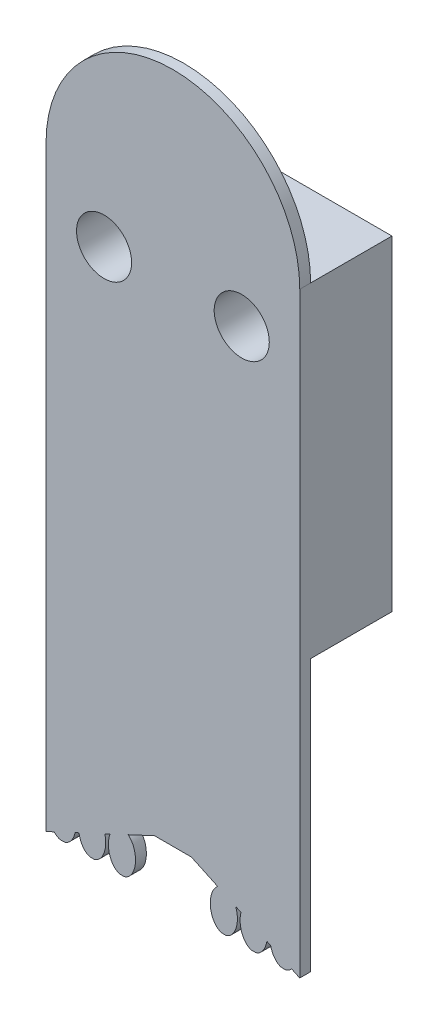
ISO-10303-21;
HEADER;
FILE_DESCRIPTION(('STEP AP214'),'2;1');
FILE_NAME('part.step','',(''),(''),'','','');
FILE_SCHEMA(('AUTOMOTIVE_DESIGN { 1 0 10303 214 1 1 1 1 }'));
ENDSEC;
DATA;
#1=APPLICATION_CONTEXT('core data for automotive mechanical design processes');
#2=APPLICATION_PROTOCOL_DEFINITION('international standard','automotive_design',2000,#1);
#3=PRODUCT_CONTEXT('',#1,'mechanical');
#4=PRODUCT('Part','Part','',(#3));
#5=PRODUCT_RELATED_PRODUCT_CATEGORY('part','',(#4));
#6=PRODUCT_DEFINITION_FORMATION('','',#4);
#7=PRODUCT_DEFINITION_CONTEXT('part definition',#1,'design');
#8=PRODUCT_DEFINITION('design','',#6,#7);
#9=PRODUCT_DEFINITION_SHAPE('','',#8);
#10=(LENGTH_UNIT() NAMED_UNIT(*) SI_UNIT(.MILLI.,.METRE.));
#11=(NAMED_UNIT(*) PLANE_ANGLE_UNIT() SI_UNIT($,.RADIAN.));
#12=(NAMED_UNIT(*) SI_UNIT($,.STERADIAN.) SOLID_ANGLE_UNIT());
#13=UNCERTAINTY_MEASURE_WITH_UNIT(LENGTH_MEASURE(1.E-05),#10,'distance_accuracy_value','');
#14=(GEOMETRIC_REPRESENTATION_CONTEXT(3) GLOBAL_UNCERTAINTY_ASSIGNED_CONTEXT((#13)) GLOBAL_UNIT_ASSIGNED_CONTEXT((#10,
#11,#12)) REPRESENTATION_CONTEXT('',''));
#15=CARTESIAN_POINT('',(0.,0.,0.));
#16=DIRECTION('',(0.,0.,1.));
#17=DIRECTION('',(1.,0.,0.));
#18=AXIS2_PLACEMENT_3D('',#15,#16,#17);
#19=CARTESIAN_POINT('',(-79.3736541190516,0.,15.));
#20=DIRECTION('',(1.,0.,0.));
#21=DIRECTION('',(0.,1.,0.));
#22=AXIS2_PLACEMENT_3D('',#19,#20,#21);
#23=PLANE('',#22);
#24=DIRECTION('',(0.,-1.,0.));
#25=VECTOR('',#24,1.);
#26=CARTESIAN_POINT('',(-79.3736541190516,0.,0.));
#27=LINE('',#26,#25);
#28=CARTESIAN_POINT('',(-79.3736541190514,-283.368909969103,0.));
#29=VERTEX_POINT('',#28);
#30=CARTESIAN_POINT('',(-79.3736541190514,-343.368909969103,0.));
#31=VERTEX_POINT('',#30);
#32=EDGE_CURVE('E79',#29,#31,#27,.T.);
#33=ORIENTED_EDGE('',*,*,#32,.F.);
#34=DIRECTION('',(0.,0.,-1.));
#35=VECTOR('',#34,1.);
#36=CARTESIAN_POINT('',(-79.3736541190514,-283.368909969103,15.));
#37=LINE('',#36,#35);
#38=CARTESIAN_POINT('',(-79.3736541190514,-283.368909969103,15.));
#39=VERTEX_POINT('',#38);
#40=EDGE_CURVE('E11',#39,#29,#37,.T.);
#41=ORIENTED_EDGE('',*,*,#40,.F.);
#42=DIRECTION('',(0.,0.,-1.));
#43=VECTOR('',#42,1.);
#44=CARTESIAN_POINT('',(-79.3736541190514,-283.368909969103,17.));
#45=LINE('',#44,#43);
#46=CARTESIAN_POINT('',(-79.3736541190514,-283.368909969103,17.));
#47=VERTEX_POINT('',#46);
#48=EDGE_CURVE('E204',#47,#39,#45,.T.);
#49=ORIENTED_EDGE('',*,*,#48,.F.);
#50=DIRECTION('',(0.,-1.,0.));
#51=VECTOR('',#50,1.);
#52=CARTESIAN_POINT('',(-79.3736541190515,0.,17.));
#53=LINE('',#52,#51);
#54=CARTESIAN_POINT('',(-79.3736541190514,-393.368909969103,17.));
#55=VERTEX_POINT('',#54);
#56=EDGE_CURVE('E131',#47,#55,#53,.T.);
#57=ORIENTED_EDGE('',*,*,#56,.T.);
#58=DIRECTION('',(0.,0.,-1.));
#59=VECTOR('',#58,1.);
#60=CARTESIAN_POINT('',(-79.3736541190514,-393.368909969103,17.));
#61=LINE('',#60,#59);
#62=CARTESIAN_POINT('',(-79.3736541190514,-393.368909969103,15.));
#63=VERTEX_POINT('',#62);
#64=EDGE_CURVE('E207',#55,#63,#61,.T.);
#65=ORIENTED_EDGE('',*,*,#64,.T.);
#66=DIRECTION('',(0.,-1.,0.));
#67=VECTOR('',#66,1.);
#68=CARTESIAN_POINT('',(-79.3736541190515,0.,15.));
#69=LINE('',#68,#67);
#70=CARTESIAN_POINT('',(-79.3736541190514,-343.368909969103,15.));
#71=VERTEX_POINT('',#70);
#72=EDGE_CURVE('E55',#71,#63,#69,.T.);
#73=ORIENTED_EDGE('',*,*,#72,.F.);
#74=DIRECTION('',(0.,0.,-1.));
#75=VECTOR('',#74,1.);
#76=CARTESIAN_POINT('',(-79.3736541190514,-343.368909969103,15.));
#77=LINE('',#76,#75);
#78=EDGE_CURVE('E91',#71,#31,#77,.T.);
#79=ORIENTED_EDGE('',*,*,#78,.T.);
#80=EDGE_LOOP('',(#33,#41,#49,#57,#65,#73,#79));
#81=FACE_BOUND('',#80,.T.);
#82=ADVANCED_FACE('F39',(#81),#23,.T.);
#83=CARTESIAN_POINT('',(0.,-283.368909969103,15.));
#84=DIRECTION('',(0.,1.,0.));
#85=DIRECTION('',(0.,0.,1.));
#86=AXIS2_PLACEMENT_3D('',#83,#84,#85);
#87=PLANE('',#86);
#88=DIRECTION('',(1.,0.,0.));
#89=VECTOR('',#88,1.);
#90=CARTESIAN_POINT('',(0.,-283.368909969103,0.));
#91=LINE('',#90,#89);
#92=CARTESIAN_POINT('',(-126.16159358842,-283.368909969103,0.));
#93=VERTEX_POINT('',#92);
#94=EDGE_CURVE('E96',#93,#29,#91,.T.);
#95=ORIENTED_EDGE('',*,*,#94,.F.);
#96=DIRECTION('',(0.,0.,-1.));
#97=VECTOR('',#96,1.);
#98=CARTESIAN_POINT('',(-126.16159358842,-283.368909969103,15.));
#99=LINE('',#98,#97);
#100=CARTESIAN_POINT('',(-126.16159358842,-283.368909969103,15.));
#101=VERTEX_POINT('',#100);
#102=EDGE_CURVE('E48',#101,#93,#99,.T.);
#103=ORIENTED_EDGE('',*,*,#102,.F.);
#104=DIRECTION('',(1.,0.,0.));
#105=VECTOR('',#104,1.);
#106=CARTESIAN_POINT('',(0.,-283.368909969103,15.));
#107=LINE('',#106,#105);
#108=EDGE_CURVE('E82',#101,#39,#107,.T.);
#109=ORIENTED_EDGE('',*,*,#108,.T.);
#110=ORIENTED_EDGE('',*,*,#40,.T.);
#111=EDGE_LOOP('',(#95,#103,#109,#110));
#112=FACE_BOUND('',#111,.T.);
#113=ADVANCED_FACE('F460',(#112),#87,.T.);
#114=CARTESIAN_POINT('',(-126.16159358842,0.,15.));
#115=DIRECTION('',(1.,0.,0.));
#116=DIRECTION('',(0.,0.,-1.));
#117=AXIS2_PLACEMENT_3D('',#114,#115,#116);
#118=PLANE('',#117);
#119=DIRECTION('',(0.,-1.,0.));
#120=VECTOR('',#119,1.);
#121=CARTESIAN_POINT('',(-126.16159358842,0.,0.));
#122=LINE('',#121,#120);
#123=CARTESIAN_POINT('',(-126.16159358842,-343.368909969103,0.));
#124=VERTEX_POINT('',#123);
#125=EDGE_CURVE('E76',#93,#124,#122,.T.);
#126=ORIENTED_EDGE('',*,*,#125,.T.);
#127=DIRECTION('',(0.,0.,-1.));
#128=VECTOR('',#127,1.);
#129=CARTESIAN_POINT('',(-126.16159358842,-343.368909969103,15.));
#130=LINE('',#129,#128);
#131=CARTESIAN_POINT('',(-126.16159358842,-343.368909969103,15.));
#132=VERTEX_POINT('',#131);
#133=EDGE_CURVE('E86',#132,#124,#130,.T.);
#134=ORIENTED_EDGE('',*,*,#133,.F.);
#135=DIRECTION('',(0.,-1.,0.));
#136=VECTOR('',#135,1.);
#137=CARTESIAN_POINT('',(-126.16159358842,0.,15.));
#138=LINE('',#137,#136);
#139=CARTESIAN_POINT('',(-126.16159358842,-393.368909969103,15.));
#140=VERTEX_POINT('',#139);
#141=EDGE_CURVE('E135',#132,#140,#138,.T.);
#142=ORIENTED_EDGE('',*,*,#141,.T.);
#143=DIRECTION('',(0.,0.,-1.));
#144=VECTOR('',#143,1.);
#145=CARTESIAN_POINT('',(-126.16159358842,-393.368909969103,17.));
#146=LINE('',#145,#144);
#147=CARTESIAN_POINT('',(-126.16159358842,-393.368909969103,17.));
#148=VERTEX_POINT('',#147);
#149=EDGE_CURVE('E112',#148,#140,#146,.T.);
#150=ORIENTED_EDGE('',*,*,#149,.F.);
#151=DIRECTION('',(0.,-1.,0.));
#152=VECTOR('',#151,1.);
#153=CARTESIAN_POINT('',(-126.16159358842,0.,17.));
#154=LINE('',#153,#152);
#155=CARTESIAN_POINT('',(-126.16159358842,-283.368909969103,17.));
#156=VERTEX_POINT('',#155);
#157=EDGE_CURVE('E202',#156,#148,#154,.T.);
#158=ORIENTED_EDGE('',*,*,#157,.F.);
#159=DIRECTION('',(0.,0.,-1.));
#160=VECTOR('',#159,1.);
#161=CARTESIAN_POINT('',(-126.16159358842,-283.368909969103,17.));
#162=LINE('',#161,#160);
#163=EDGE_CURVE('E128',#156,#101,#162,.T.);
#164=ORIENTED_EDGE('',*,*,#163,.T.);
#165=ORIENTED_EDGE('',*,*,#102,.T.);
#166=EDGE_LOOP('',(#126,#134,#142,#150,#158,#164,#165));
#167=FACE_BOUND('',#166,.T.);
#168=ADVANCED_FACE('F93',(#167),#118,.F.);
#169=CARTESIAN_POINT('',(-115.46159358842,-294.630909969103,15.));
#170=DIRECTION('',(0.,0.,-1.));
#171=DIRECTION('',(-1.,0.,0.));
#172=AXIS2_PLACEMENT_3D('',#169,#170,#171);
#173=CYLINDRICAL_SURFACE('',#172,5.08000000000001);
#174=CARTESIAN_POINT('',(-115.46159358842,-294.630909969103,0.));
#175=DIRECTION('',(0.,0.,1.));
#176=DIRECTION('',(1.,0.,0.));
#177=AXIS2_PLACEMENT_3D('',#174,#175,#176);
#178=CIRCLE('',#177,5.08000000000001);
#179=CARTESIAN_POINT('',(-110.38159358842,-294.630909969103,0.));
#180=VERTEX_POINT('',#179);
#181=EDGE_CURVE('E111',#180,#180,#178,.T.);
#182=ORIENTED_EDGE('',*,*,#181,.F.);
#183=EDGE_LOOP('',(#182));
#184=FACE_BOUND('',#183,.T.);
#185=CARTESIAN_POINT('',(-115.46159358842,-294.630909969103,17.));
#186=DIRECTION('',(0.,0.,1.));
#187=DIRECTION('',(1.,0.,0.));
#188=AXIS2_PLACEMENT_3D('',#185,#186,#187);
#189=CIRCLE('',#188,5.08000000000001);
#190=CARTESIAN_POINT('',(-110.38159358842,-294.630909969103,17.));
#191=VERTEX_POINT('',#190);
#192=EDGE_CURVE('E122',#191,#191,#189,.F.);
#193=ORIENTED_EDGE('',*,*,#192,.F.);
#194=EDGE_LOOP('',(#193));
#195=FACE_BOUND('',#194,.T.);
#196=ADVANCED_FACE('F117',(#184,#195),#173,.F.);
#197=CARTESIAN_POINT('',(-90.0736541190514,-294.630909969103,15.));
#198=DIRECTION('',(0.,0.,-1.));
#199=DIRECTION('',(-1.,0.,0.));
#200=AXIS2_PLACEMENT_3D('',#197,#198,#199);
#201=CYLINDRICAL_SURFACE('',#200,5.08000000000001);
#202=CARTESIAN_POINT('',(-90.0736541190514,-294.630909969103,0.));
#203=DIRECTION('',(0.,0.,1.));
#204=DIRECTION('',(1.,0.,0.));
#205=AXIS2_PLACEMENT_3D('',#202,#203,#204);
#206=CIRCLE('',#205,5.08000000000001);
#207=CARTESIAN_POINT('',(-84.9936541190514,-294.630909969103,0.));
#208=VERTEX_POINT('',#207);
#209=EDGE_CURVE('E108',#208,#208,#206,.T.);
#210=ORIENTED_EDGE('',*,*,#209,.F.);
#211=EDGE_LOOP('',(#210));
#212=FACE_BOUND('',#211,.T.);
#213=CARTESIAN_POINT('',(-90.0736541190514,-294.630909969103,17.));
#214=DIRECTION('',(0.,0.,1.));
#215=DIRECTION('',(1.,0.,0.));
#216=AXIS2_PLACEMENT_3D('',#213,#214,#215);
#217=CIRCLE('',#216,5.08000000000001);
#218=CARTESIAN_POINT('',(-84.9936541190514,-294.630909969103,17.));
#219=VERTEX_POINT('',#218);
#220=EDGE_CURVE('E124',#219,#219,#217,.F.);
#221=ORIENTED_EDGE('',*,*,#220,.F.);
#222=EDGE_LOOP('',(#221));
#223=FACE_BOUND('',#222,.T.);
#224=ADVANCED_FACE('F41',(#212,#223),#201,.F.);
#225=CARTESIAN_POINT('',(0.,-343.368909969103,15.));
#226=DIRECTION('',(0.,1.,0.));
#227=DIRECTION('',(0.,0.,1.));
#228=AXIS2_PLACEMENT_3D('',#225,#226,#227);
#229=PLANE('',#228);
#230=DIRECTION('',(1.,0.,0.));
#231=VECTOR('',#230,1.);
#232=CARTESIAN_POINT('',(0.,-343.368909969103,0.));
#233=LINE('',#232,#231);
#234=EDGE_CURVE('E71',#124,#31,#233,.T.);
#235=ORIENTED_EDGE('',*,*,#234,.T.);
#236=ORIENTED_EDGE('',*,*,#78,.F.);
#237=DIRECTION('',(1.,0.,0.));
#238=VECTOR('',#237,1.);
#239=CARTESIAN_POINT('',(0.,-343.368909969103,15.));
#240=LINE('',#239,#238);
#241=EDGE_CURVE('E88',#132,#71,#240,.T.);
#242=ORIENTED_EDGE('',*,*,#241,.F.);
#243=ORIENTED_EDGE('',*,*,#133,.T.);
#244=EDGE_LOOP('',(#235,#236,#242,#243));
#245=FACE_BOUND('',#244,.T.);
#246=ADVANCED_FACE('F87',(#245),#229,.F.);
#247=CARTESIAN_POINT('',(0.,0.,0.));
#248=DIRECTION('',(0.,0.,1.));
#249=DIRECTION('',(1.,0.,0.));
#250=AXIS2_PLACEMENT_3D('',#247,#248,#249);
#251=PLANE('',#250);
#252=ORIENTED_EDGE('',*,*,#209,.T.);
#253=EDGE_LOOP('',(#252));
#254=FACE_BOUND('',#253,.T.);
#255=ORIENTED_EDGE('',*,*,#181,.T.);
#256=EDGE_LOOP('',(#255));
#257=FACE_BOUND('',#256,.T.);
#258=ORIENTED_EDGE('',*,*,#32,.T.);
#259=ORIENTED_EDGE('',*,*,#234,.F.);
#260=ORIENTED_EDGE('',*,*,#125,.F.);
#261=ORIENTED_EDGE('',*,*,#94,.T.);
#262=EDGE_LOOP('',(#258,#259,#260,#261));
#263=FACE_BOUND('',#262,.T.);
#264=ADVANCED_FACE('F73',(#254,#257,#263),#251,.F.);
#265=CARTESIAN_POINT('',(0.,0.,15.));
#266=DIRECTION('',(0.,0.,1.));
#267=DIRECTION('',(1.,0.,0.));
#268=AXIS2_PLACEMENT_3D('',#265,#266,#267);
#269=PLANE('',#268);
#270=ORIENTED_EDGE('',*,*,#141,.F.);
#271=ORIENTED_EDGE('',*,*,#241,.T.);
#272=ORIENTED_EDGE('',*,*,#72,.T.);
#273=DIRECTION('',(-0.906307787036652,0.422618261740694,0.));
#274=VECTOR('',#273,1.);
#275=CARTESIAN_POINT('',(-164.845660146689,-353.512659000546,15.));
#276=LINE('',#275,#274);
#277=CARTESIAN_POINT('',(-80.880341233661,-392.666330229117,15.));
#278=VERTEX_POINT('',#277);
#279=EDGE_CURVE('E195',#63,#278,#276,.T.);
#280=ORIENTED_EDGE('',*,*,#279,.T.);
#281=CARTESIAN_POINT('',(-82.3736541190514,-389.658833361416,15.));
#282=DIRECTION('',(0.,0.,-1.));
#283=DIRECTION('',(0.,1.,0.));
#284=AXIS2_PLACEMENT_3D('',#281,#282,#283);
#285=ELLIPSE('',#284,3.74999999999998,2.5);
#286=CARTESIAN_POINT('',(-82.0098278081775,-393.368909969103,15.));
#287=VERTEX_POINT('',#286);
#288=EDGE_CURVE('E194',#278,#287,#285,.T.);
#289=ORIENTED_EDGE('',*,*,#288,.T.);
#290=DIRECTION('',(1.,0.,0.));
#291=VECTOR('',#290,1.);
#292=CARTESIAN_POINT('',(0.,-393.368909969103,15.));
#293=LINE('',#292,#291);
#294=CARTESIAN_POINT('',(-82.7374804299253,-393.368909969103,15.));
#295=VERTEX_POINT('',#294);
#296=EDGE_CURVE('E179',#295,#287,#293,.T.);
#297=ORIENTED_EDGE('',*,*,#296,.F.);
#298=CARTESIAN_POINT('',(-84.7405099488571,-390.866303995451,15.));
#299=VERTEX_POINT('',#298);
#300=EDGE_CURVE('E191',#295,#299,#285,.T.);
#301=ORIENTED_EDGE('',*,*,#300,.T.);
#302=DIRECTION('',(-0.906307787036654,0.422618261740692,0.));
#303=VECTOR('',#302,1.);
#304=CARTESIAN_POINT('',(-164.845660146688,-353.512659000547,15.));
#305=LINE('',#304,#303);
#306=CARTESIAN_POINT('',(-85.44341611312,-390.538533468091,15.));
#307=VERTEX_POINT('',#306);
#308=EDGE_CURVE('E188',#299,#307,#305,.T.);
#309=ORIENTED_EDGE('',*,*,#308,.T.);
#310=CARTESIAN_POINT('',(-87.8736541190514,-389.658833361416,15.));
#311=DIRECTION('',(0.,0.,-1.));
#312=DIRECTION('',(0.,1.,0.));
#313=AXIS2_PLACEMENT_3D('',#310,#311,#312);
#314=ELLIPSE('',#313,3.74999999999998,2.5);
#315=CARTESIAN_POINT('',(-87.5098278081775,-393.368909969103,15.));
#316=VERTEX_POINT('',#315);
#317=EDGE_CURVE('E187',#307,#316,#314,.T.);
#318=ORIENTED_EDGE('',*,*,#317,.T.);
#319=CARTESIAN_POINT('',(-88.2374804299253,-393.368909969103,15.));
#320=VERTEX_POINT('',#319);
#321=EDGE_CURVE('E180',#320,#316,#293,.T.);
#322=ORIENTED_EDGE('',*,*,#321,.F.);
#323=CARTESIAN_POINT('',(-90.2080625994379,-388.31674232312,15.));
#324=VERTEX_POINT('',#323);
#325=EDGE_CURVE('E184',#320,#324,#314,.T.);
#326=ORIENTED_EDGE('',*,*,#325,.T.);
#327=DIRECTION('',(-0.906307787036678,0.42261826174064,0.));
#328=VECTOR('',#327,1.);
#329=CARTESIAN_POINT('',(-164.84566014667,-353.512659000561,15.));
#330=LINE('',#329,#328);
#331=CARTESIAN_POINT('',(-91.1785263244252,-387.864207656196,15.));
#332=VERTEX_POINT('',#331);
#333=EDGE_CURVE('E181',#324,#332,#330,.T.);
#334=ORIENTED_EDGE('',*,*,#333,.T.);
#335=CARTESIAN_POINT('',(-93.3736541190514,-389.658833361416,15.));
#336=DIRECTION('',(0.,0.,-1.));
#337=DIRECTION('',(0.,1.,0.));
#338=AXIS2_PLACEMENT_3D('',#335,#336,#337);
#339=ELLIPSE('',#338,3.74999999999998,2.5);
#340=CARTESIAN_POINT('',(-93.0098278081775,-393.368909969103,15.));
#341=VERTEX_POINT('',#340);
#342=EDGE_CURVE('E176',#332,#341,#339,.T.);
#343=ORIENTED_EDGE('',*,*,#342,.T.);
#344=CARTESIAN_POINT('',(-93.7374804299253,-393.368909969103,15.));
#345=VERTEX_POINT('',#344);
#346=EDGE_CURVE('E175',#345,#341,#293,.T.);
#347=ORIENTED_EDGE('',*,*,#346,.F.);
#348=CARTESIAN_POINT('',(-94.5035799181724,-386.313709701656,15.));
#349=VERTEX_POINT('',#348);
#350=EDGE_CURVE('E172',#345,#349,#339,.T.);
#351=ORIENTED_EDGE('',*,*,#350,.T.);
#352=DIRECTION('',(-0.906307787036653,0.422618261740693,0.));
#353=VECTOR('',#352,1.);
#354=CARTESIAN_POINT('',(-164.845660146688,-353.512659000546,15.));
#355=LINE('',#354,#353);
#356=CARTESIAN_POINT('',(-99.3736541190514,-384.042756806003,15.));
#357=VERTEX_POINT('',#356);
#358=EDGE_CURVE('E169',#349,#357,#355,.T.);
#359=ORIENTED_EDGE('',*,*,#358,.T.);
#360=DIRECTION('',(1.,0.,0.));
#361=VECTOR('',#360,1.);
#362=CARTESIAN_POINT('',(-6.28133342924796E-12,-384.042756806005,15.));
#363=LINE('',#362,#361);
#364=CARTESIAN_POINT('',(-106.16159358842,-384.042756806003,15.));
#365=VERTEX_POINT('',#364);
#366=EDGE_CURVE('E166',#365,#357,#363,.T.);
#367=ORIENTED_EDGE('',*,*,#366,.F.);
#368=DIRECTION('',(0.906307787036691,0.422618261740612,0.));
#369=VECTOR('',#368,1.);
#370=CARTESIAN_POINT('',(128.135791583047,-274.788091814884,15.));
#371=LINE('',#370,#369);
#372=CARTESIAN_POINT('',(-111.031667789299,-386.313709701656,15.));
#373=VERTEX_POINT('',#372);
#374=EDGE_CURVE('E163',#373,#365,#371,.T.);
#375=ORIENTED_EDGE('',*,*,#374,.F.);
#376=CARTESIAN_POINT('',(-112.16159358842,-389.658833361416,15.));
#377=DIRECTION('',(0.,0.,1.));
#378=DIRECTION('',(0.,1.,0.));
#379=AXIS2_PLACEMENT_3D('',#376,#377,#378);
#380=ELLIPSE('',#379,3.74999999999998,2.5);
#381=CARTESIAN_POINT('',(-111.797767277546,-393.368909969103,15.));
#382=VERTEX_POINT('',#381);
#383=EDGE_CURVE('E162',#382,#373,#380,.T.);
#384=ORIENTED_EDGE('',*,*,#383,.F.);
#385=DIRECTION('',(1.,0.,0.));
#386=VECTOR('',#385,1.);
#387=CARTESIAN_POINT('',(0.,-393.368909969103,15.));
#388=LINE('',#387,#386);
#389=CARTESIAN_POINT('',(-112.525419899294,-393.368909969103,15.));
#390=VERTEX_POINT('',#389);
#391=EDGE_CURVE('E147',#390,#382,#388,.T.);
#392=ORIENTED_EDGE('',*,*,#391,.F.);
#393=CARTESIAN_POINT('',(-114.356721383046,-387.864207656196,15.));
#394=VERTEX_POINT('',#393);
#395=EDGE_CURVE('E159',#394,#390,#380,.T.);
#396=ORIENTED_EDGE('',*,*,#395,.F.);
#397=DIRECTION('',(0.90630778703676,0.422618261740463,0.));
#398=VECTOR('',#397,1.);
#399=CARTESIAN_POINT('',(128.135791583021,-274.788091814946,15.));
#400=LINE('',#399,#398);
#401=CARTESIAN_POINT('',(-115.327185108033,-388.316742323119,15.));
#402=VERTEX_POINT('',#401);
#403=EDGE_CURVE('E156',#402,#394,#400,.T.);
#404=ORIENTED_EDGE('',*,*,#403,.F.);
#405=CARTESIAN_POINT('',(-117.66159358842,-389.658833361416,15.));
#406=DIRECTION('',(0.,0.,1.));
#407=DIRECTION('',(0.,1.,0.));
#408=AXIS2_PLACEMENT_3D('',#405,#406,#407);
#409=ELLIPSE('',#408,3.74999999999998,2.5);
#410=CARTESIAN_POINT('',(-117.297767277546,-393.368909969103,15.));
#411=VERTEX_POINT('',#410);
#412=EDGE_CURVE('E155',#411,#402,#409,.T.);
#413=ORIENTED_EDGE('',*,*,#412,.F.);
#414=CARTESIAN_POINT('',(-118.025419899294,-393.368909969103,15.));
#415=VERTEX_POINT('',#414);
#416=EDGE_CURVE('E148',#415,#411,#388,.T.);
#417=ORIENTED_EDGE('',*,*,#416,.F.);
#418=CARTESIAN_POINT('',(-120.091831594351,-390.538533468091,15.));
#419=VERTEX_POINT('',#418);
#420=EDGE_CURVE('E152',#419,#415,#409,.T.);
#421=ORIENTED_EDGE('',*,*,#420,.F.);
#422=DIRECTION('',(0.906307787036657,0.422618261740685,0.));
#423=VECTOR('',#422,1.);
#424=CARTESIAN_POINT('',(128.135791583061,-274.788091814855,15.));
#425=LINE('',#424,#423);
#426=CARTESIAN_POINT('',(-120.794737758614,-390.866303995451,15.));
#427=VERTEX_POINT('',#426);
#428=EDGE_CURVE('E149',#427,#419,#425,.T.);
#429=ORIENTED_EDGE('',*,*,#428,.F.);
#430=CARTESIAN_POINT('',(-123.16159358842,-389.658833361416,15.));
#431=DIRECTION('',(0.,0.,1.));
#432=DIRECTION('',(0.,1.,0.));
#433=AXIS2_PLACEMENT_3D('',#430,#431,#432);
#434=ELLIPSE('',#433,3.74999999999998,2.5);
#435=CARTESIAN_POINT('',(-122.797767277546,-393.368909969103,15.));
#436=VERTEX_POINT('',#435);
#437=EDGE_CURVE('E144',#436,#427,#434,.T.);
#438=ORIENTED_EDGE('',*,*,#437,.F.);
#439=CARTESIAN_POINT('',(-123.525419899294,-393.368909969103,15.));
#440=VERTEX_POINT('',#439);
#441=EDGE_CURVE('E143',#440,#436,#388,.T.);
#442=ORIENTED_EDGE('',*,*,#441,.F.);
#443=CARTESIAN_POINT('',(-124.65490647381,-392.666330229117,15.));
#444=VERTEX_POINT('',#443);
#445=EDGE_CURVE('E140',#444,#440,#434,.T.);
#446=ORIENTED_EDGE('',*,*,#445,.F.);
#447=DIRECTION('',(0.906307787036652,0.422618261740694,0.));
#448=VECTOR('',#447,1.);
#449=CARTESIAN_POINT('',(128.135791583062,-274.788091814852,15.));
#450=LINE('',#449,#448);
#451=EDGE_CURVE('E137',#140,#444,#450,.T.);
#452=ORIENTED_EDGE('',*,*,#451,.F.);
#453=EDGE_LOOP('',(#270,#271,#272,#280,#289,#297,#301,#309,#318,#322,#326,#334,#343,#347,#351,
#359,#367,#375,#384,#392,#396,#404,#413,#417,#421,#429,#438,#442,#446,#452));
#454=FACE_BOUND('',#453,.T.);
#455=ADVANCED_FACE('F474',(#454),#269,.F.);
#456=CARTESIAN_POINT('',(128.135791583062,-274.788091814852,17.));
#457=DIRECTION('',(-0.422618261740694,0.906307787036652,0.));
#458=DIRECTION('',(-0.906307787036652,-0.422618261740694,0.));
#459=AXIS2_PLACEMENT_3D('',#456,#457,#458);
#460=PLANE('',#459);
#461=ORIENTED_EDGE('',*,*,#451,.T.);
#462=DIRECTION('',(0.,0.,-1.));
#463=VECTOR('',#462,1.);
#464=CARTESIAN_POINT('',(-124.65490647381,-392.666330229117,17.));
#465=LINE('',#464,#463);
#466=CARTESIAN_POINT('',(-124.65490647381,-392.666330229117,17.));
#467=VERTEX_POINT('',#466);
#468=EDGE_CURVE('E284',#467,#444,#465,.T.);
#469=ORIENTED_EDGE('',*,*,#468,.F.);
#470=DIRECTION('',(0.906307787036652,0.422618261740694,0.));
#471=VECTOR('',#470,1.);
#472=CARTESIAN_POINT('',(128.135791583062,-274.788091814852,17.));
#473=LINE('',#472,#471);
#474=EDGE_CURVE('E297',#148,#467,#473,.T.);
#475=ORIENTED_EDGE('',*,*,#474,.F.);
#476=ORIENTED_EDGE('',*,*,#149,.T.);
#477=EDGE_LOOP('',(#461,#469,#475,#476));
#478=FACE_BOUND('',#477,.T.);
#479=ADVANCED_FACE('F291',(#478),#460,.F.);
#480=CARTESIAN_POINT('',(-123.16159358842,-389.658833361416,17.));
#481=DIRECTION('',(0.,0.,1.));
#482=DIRECTION('',(0.,1.,0.));
#483=AXIS2_PLACEMENT_3D('',#480,#481,#482);
#484=ELLIPSE('',#483,3.74999999999998,2.5);
#485=DIRECTION('',(0.,0.,-1.));
#486=VECTOR('',#485,1.);
#487=SURFACE_OF_LINEAR_EXTRUSION('',#484,#486);
#488=ORIENTED_EDGE('',*,*,#445,.T.);
#489=DIRECTION('',(0.,0.,-1.));
#490=VECTOR('',#489,1.);
#491=CARTESIAN_POINT('',(-123.525419899294,-393.368909969103,17.));
#492=LINE('',#491,#490);
#493=CARTESIAN_POINT('',(-123.525419899294,-393.368909969103,17.));
#494=VERTEX_POINT('',#493);
#495=EDGE_CURVE('E281',#494,#440,#492,.T.);
#496=ORIENTED_EDGE('',*,*,#495,.F.);
#497=EDGE_CURVE('E487',#467,#494,#484,.T.);
#498=ORIENTED_EDGE('',*,*,#497,.F.);
#499=ORIENTED_EDGE('',*,*,#468,.T.);
#500=EDGE_LOOP('',(#488,#496,#498,#499));
#501=FACE_BOUND('',#500,.T.);
#502=ADVANCED_FACE('F478',(#501),#487,.F.);
#503=CARTESIAN_POINT('',(0.,-393.368909969103,17.));
#504=DIRECTION('',(0.,1.,0.));
#505=DIRECTION('',(0.,0.,1.));
#506=AXIS2_PLACEMENT_3D('',#503,#504,#505);
#507=PLANE('',#506);
#508=ORIENTED_EDGE('',*,*,#441,.T.);
#509=DIRECTION('',(0.,0.,-1.));
#510=VECTOR('',#509,1.);
#511=CARTESIAN_POINT('',(-122.797767277546,-393.368909969103,17.));
#512=LINE('',#511,#510);
#513=CARTESIAN_POINT('',(-122.797767277546,-393.368909969103,17.));
#514=VERTEX_POINT('',#513);
#515=EDGE_CURVE('E278',#514,#436,#512,.T.);
#516=ORIENTED_EDGE('',*,*,#515,.F.);
#517=DIRECTION('',(1.,0.,0.));
#518=VECTOR('',#517,1.);
#519=CARTESIAN_POINT('',(0.,-393.368909969103,17.));
#520=LINE('',#519,#518);
#521=EDGE_CURVE('E491',#494,#514,#520,.T.);
#522=ORIENTED_EDGE('',*,*,#521,.F.);
#523=ORIENTED_EDGE('',*,*,#495,.T.);
#524=EDGE_LOOP('',(#508,#516,#522,#523));
#525=FACE_BOUND('',#524,.T.);
#526=ADVANCED_FACE('F484',(#525),#507,.F.);
#527=ORIENTED_EDGE('',*,*,#437,.T.);
#528=DIRECTION('',(0.,0.,-1.));
#529=VECTOR('',#528,1.);
#530=CARTESIAN_POINT('',(-120.794737758614,-390.866303995451,17.));
#531=LINE('',#530,#529);
#532=CARTESIAN_POINT('',(-120.794737758614,-390.866303995451,17.));
#533=VERTEX_POINT('',#532);
#534=EDGE_CURVE('E275',#533,#427,#531,.T.);
#535=ORIENTED_EDGE('',*,*,#534,.F.);
#536=EDGE_CURVE('E492',#514,#533,#484,.T.);
#537=ORIENTED_EDGE('',*,*,#536,.F.);
#538=ORIENTED_EDGE('',*,*,#515,.T.);
#539=EDGE_LOOP('',(#527,#535,#537,#538));
#540=FACE_BOUND('',#539,.T.);
#541=ADVANCED_FACE('F479',(#540),#487,.F.);
#542=CARTESIAN_POINT('',(128.135791583061,-274.788091814855,17.));
#543=DIRECTION('',(-0.422618261740685,0.906307787036657,0.));
#544=DIRECTION('',(-0.906307787036657,-0.422618261740685,0.));
#545=AXIS2_PLACEMENT_3D('',#542,#543,#544);
#546=PLANE('',#545);
#547=ORIENTED_EDGE('',*,*,#428,.T.);
#548=DIRECTION('',(0.,0.,-1.));
#549=VECTOR('',#548,1.);
#550=CARTESIAN_POINT('',(-120.091831594351,-390.538533468091,17.));
#551=LINE('',#550,#549);
#552=CARTESIAN_POINT('',(-120.091831594351,-390.538533468091,17.));
#553=VERTEX_POINT('',#552);
#554=EDGE_CURVE('E272',#553,#419,#551,.T.);
#555=ORIENTED_EDGE('',*,*,#554,.F.);
#556=DIRECTION('',(0.906307787036657,0.422618261740685,0.));
#557=VECTOR('',#556,1.);
#558=CARTESIAN_POINT('',(128.135791583061,-274.788091814855,17.));
#559=LINE('',#558,#557);
#560=EDGE_CURVE('E497',#533,#553,#559,.T.);
#561=ORIENTED_EDGE('',*,*,#560,.F.);
#562=ORIENTED_EDGE('',*,*,#534,.T.);
#563=EDGE_LOOP('',(#547,#555,#561,#562));
#564=FACE_BOUND('',#563,.T.);
#565=ADVANCED_FACE('F483',(#564),#546,.F.);
#566=CARTESIAN_POINT('',(-117.66159358842,-389.658833361416,17.));
#567=DIRECTION('',(0.,0.,1.));
#568=DIRECTION('',(0.,1.,0.));
#569=AXIS2_PLACEMENT_3D('',#566,#567,#568);
#570=ELLIPSE('',#569,3.74999999999998,2.5);
#571=DIRECTION('',(0.,0.,-1.));
#572=VECTOR('',#571,1.);
#573=SURFACE_OF_LINEAR_EXTRUSION('',#570,#572);
#574=ORIENTED_EDGE('',*,*,#420,.T.);
#575=DIRECTION('',(0.,0.,-1.));
#576=VECTOR('',#575,1.);
#577=CARTESIAN_POINT('',(-118.025419899294,-393.368909969103,17.));
#578=LINE('',#577,#576);
#579=CARTESIAN_POINT('',(-118.025419899294,-393.368909969103,17.));
#580=VERTEX_POINT('',#579);
#581=EDGE_CURVE('E269',#580,#415,#578,.T.);
#582=ORIENTED_EDGE('',*,*,#581,.F.);
#583=EDGE_CURVE('E499',#553,#580,#570,.T.);
#584=ORIENTED_EDGE('',*,*,#583,.F.);
#585=ORIENTED_EDGE('',*,*,#554,.T.);
#586=EDGE_LOOP('',(#574,#582,#584,#585));
#587=FACE_BOUND('',#586,.T.);
#588=ADVANCED_FACE('F511',(#587),#573,.F.);
#589=ORIENTED_EDGE('',*,*,#416,.T.);
#590=DIRECTION('',(0.,0.,-1.));
#591=VECTOR('',#590,1.);
#592=CARTESIAN_POINT('',(-117.297767277546,-393.368909969103,17.));
#593=LINE('',#592,#591);
#594=CARTESIAN_POINT('',(-117.297767277546,-393.368909969103,17.));
#595=VERTEX_POINT('',#594);
#596=EDGE_CURVE('E266',#595,#411,#593,.T.);
#597=ORIENTED_EDGE('',*,*,#596,.F.);
#598=EDGE_CURVE('E496',#580,#595,#520,.T.);
#599=ORIENTED_EDGE('',*,*,#598,.F.);
#600=ORIENTED_EDGE('',*,*,#581,.T.);
#601=EDGE_LOOP('',(#589,#597,#599,#600));
#602=FACE_BOUND('',#601,.T.);
#603=ADVANCED_FACE('F509',(#602),#507,.F.);
#604=ORIENTED_EDGE('',*,*,#412,.T.);
#605=DIRECTION('',(0.,0.,-1.));
#606=VECTOR('',#605,1.);
#607=CARTESIAN_POINT('',(-115.327185108033,-388.316742323119,17.));
#608=LINE('',#607,#606);
#609=CARTESIAN_POINT('',(-115.327185108033,-388.316742323119,17.));
#610=VERTEX_POINT('',#609);
#611=EDGE_CURVE('E263',#610,#402,#608,.T.);
#612=ORIENTED_EDGE('',*,*,#611,.F.);
#613=EDGE_CURVE('E502',#595,#610,#570,.T.);
#614=ORIENTED_EDGE('',*,*,#613,.F.);
#615=ORIENTED_EDGE('',*,*,#596,.T.);
#616=EDGE_LOOP('',(#604,#612,#614,#615));
#617=FACE_BOUND('',#616,.T.);
#618=ADVANCED_FACE('F505',(#617),#573,.F.);
#619=CARTESIAN_POINT('',(128.135791583021,-274.788091814946,17.));
#620=DIRECTION('',(-0.422618261740463,0.90630778703676,0.));
#621=DIRECTION('',(-0.90630778703676,-0.422618261740463,0.));
#622=AXIS2_PLACEMENT_3D('',#619,#620,#621);
#623=PLANE('',#622);
#624=ORIENTED_EDGE('',*,*,#403,.T.);
#625=DIRECTION('',(0.,0.,-1.));
#626=VECTOR('',#625,1.);
#627=CARTESIAN_POINT('',(-114.356721383046,-387.864207656196,17.));
#628=LINE('',#627,#626);
#629=CARTESIAN_POINT('',(-114.356721383046,-387.864207656196,17.));
#630=VERTEX_POINT('',#629);
#631=EDGE_CURVE('E260',#630,#394,#628,.T.);
#632=ORIENTED_EDGE('',*,*,#631,.F.);
#633=DIRECTION('',(0.90630778703676,0.422618261740463,0.));
#634=VECTOR('',#633,1.);
#635=CARTESIAN_POINT('',(128.135791583021,-274.788091814946,17.));
#636=LINE('',#635,#634);
#637=EDGE_CURVE('E503',#610,#630,#636,.T.);
#638=ORIENTED_EDGE('',*,*,#637,.F.);
#639=ORIENTED_EDGE('',*,*,#611,.T.);
#640=EDGE_LOOP('',(#624,#632,#638,#639));
#641=FACE_BOUND('',#640,.T.);
#642=ADVANCED_FACE('F508',(#641),#623,.F.);
#643=CARTESIAN_POINT('',(-112.16159358842,-389.658833361416,17.));
#644=DIRECTION('',(0.,0.,1.));
#645=DIRECTION('',(0.,1.,0.));
#646=AXIS2_PLACEMENT_3D('',#643,#644,#645);
#647=ELLIPSE('',#646,3.74999999999998,2.5);
#648=DIRECTION('',(0.,0.,-1.));
#649=VECTOR('',#648,1.);
#650=SURFACE_OF_LINEAR_EXTRUSION('',#647,#649);
#651=ORIENTED_EDGE('',*,*,#395,.T.);
#652=DIRECTION('',(0.,0.,-1.));
#653=VECTOR('',#652,1.);
#654=CARTESIAN_POINT('',(-112.525419899294,-393.368909969103,17.));
#655=LINE('',#654,#653);
#656=CARTESIAN_POINT('',(-112.525419899294,-393.368909969103,17.));
#657=VERTEX_POINT('',#656);
#658=EDGE_CURVE('E257',#657,#390,#655,.T.);
#659=ORIENTED_EDGE('',*,*,#658,.F.);
#660=EDGE_CURVE('E526',#630,#657,#647,.T.);
#661=ORIENTED_EDGE('',*,*,#660,.F.);
#662=ORIENTED_EDGE('',*,*,#631,.T.);
#663=EDGE_LOOP('',(#651,#659,#661,#662));
#664=FACE_BOUND('',#663,.T.);
#665=ADVANCED_FACE('F514',(#664),#650,.F.);
#666=ORIENTED_EDGE('',*,*,#391,.T.);
#667=DIRECTION('',(0.,0.,-1.));
#668=VECTOR('',#667,1.);
#669=CARTESIAN_POINT('',(-111.797767277546,-393.368909969103,17.));
#670=LINE('',#669,#668);
#671=CARTESIAN_POINT('',(-111.797767277546,-393.368909969103,17.));
#672=VERTEX_POINT('',#671);
#673=EDGE_CURVE('E254',#672,#382,#670,.T.);
#674=ORIENTED_EDGE('',*,*,#673,.F.);
#675=EDGE_CURVE('E495',#657,#672,#520,.T.);
#676=ORIENTED_EDGE('',*,*,#675,.F.);
#677=ORIENTED_EDGE('',*,*,#658,.T.);
#678=EDGE_LOOP('',(#666,#674,#676,#677));
#679=FACE_BOUND('',#678,.T.);
#680=ADVANCED_FACE('F516',(#679),#507,.F.);
#681=ORIENTED_EDGE('',*,*,#383,.T.);
#682=DIRECTION('',(0.,0.,-1.));
#683=VECTOR('',#682,1.);
#684=CARTESIAN_POINT('',(-111.031667789299,-386.313709701656,17.));
#685=LINE('',#684,#683);
#686=CARTESIAN_POINT('',(-111.031667789299,-386.313709701656,17.));
#687=VERTEX_POINT('',#686);
#688=EDGE_CURVE('E251',#687,#373,#685,.T.);
#689=ORIENTED_EDGE('',*,*,#688,.F.);
#690=EDGE_CURVE('E529',#672,#687,#647,.T.);
#691=ORIENTED_EDGE('',*,*,#690,.F.);
#692=ORIENTED_EDGE('',*,*,#673,.T.);
#693=EDGE_LOOP('',(#681,#689,#691,#692));
#694=FACE_BOUND('',#693,.T.);
#695=ADVANCED_FACE('F519',(#694),#650,.F.);
#696=CARTESIAN_POINT('',(128.135791583047,-274.788091814884,17.));
#697=DIRECTION('',(-0.422618261740612,0.906307787036691,0.));
#698=DIRECTION('',(-0.906307787036691,-0.422618261740612,0.));
#699=AXIS2_PLACEMENT_3D('',#696,#697,#698);
#700=PLANE('',#699);
#701=ORIENTED_EDGE('',*,*,#374,.T.);
#702=DIRECTION('',(0.,0.,-1.));
#703=VECTOR('',#702,1.);
#704=CARTESIAN_POINT('',(-106.16159358842,-384.042756806003,17.));
#705=LINE('',#704,#703);
#706=CARTESIAN_POINT('',(-106.16159358842,-384.042756806003,17.));
#707=VERTEX_POINT('',#706);
#708=EDGE_CURVE('E248',#707,#365,#705,.T.);
#709=ORIENTED_EDGE('',*,*,#708,.F.);
#710=DIRECTION('',(0.906307787036691,0.422618261740612,0.));
#711=VECTOR('',#710,1.);
#712=CARTESIAN_POINT('',(128.135791583047,-274.788091814884,17.));
#713=LINE('',#712,#711);
#714=EDGE_CURVE('E530',#687,#707,#713,.T.);
#715=ORIENTED_EDGE('',*,*,#714,.F.);
#716=ORIENTED_EDGE('',*,*,#688,.T.);
#717=EDGE_LOOP('',(#701,#709,#715,#716));
#718=FACE_BOUND('',#717,.T.);
#719=ADVANCED_FACE('F523',(#718),#700,.F.);
#720=CARTESIAN_POINT('',(-6.28133342924796E-12,-384.042756806005,17.));
#721=DIRECTION('',(0.,1.,0.));
#722=DIRECTION('',(-1.,0.,0.));
#723=AXIS2_PLACEMENT_3D('',#720,#721,#722);
#724=PLANE('',#723);
#725=ORIENTED_EDGE('',*,*,#366,.T.);
#726=DIRECTION('',(0.,0.,-1.));
#727=VECTOR('',#726,1.);
#728=CARTESIAN_POINT('',(-99.3736541190514,-384.042756806003,17.));
#729=LINE('',#728,#727);
#730=CARTESIAN_POINT('',(-99.3736541190514,-384.042756806003,17.));
#731=VERTEX_POINT('',#730);
#732=EDGE_CURVE('E245',#731,#357,#729,.T.);
#733=ORIENTED_EDGE('',*,*,#732,.F.);
#734=DIRECTION('',(1.,0.,0.));
#735=VECTOR('',#734,1.);
#736=CARTESIAN_POINT('',(-6.28133342924796E-12,-384.042756806005,17.));
#737=LINE('',#736,#735);
#738=EDGE_CURVE('E532',#707,#731,#737,.T.);
#739=ORIENTED_EDGE('',*,*,#738,.F.);
#740=ORIENTED_EDGE('',*,*,#708,.T.);
#741=EDGE_LOOP('',(#725,#733,#739,#740));
#742=FACE_BOUND('',#741,.T.);
#743=ADVANCED_FACE('F556',(#742),#724,.F.);
#744=CARTESIAN_POINT('',(-164.845660146688,-353.512659000546,17.));
#745=DIRECTION('',(-0.422618261740693,-0.906307787036653,0.));
#746=DIRECTION('',(0.906307787036653,-0.422618261740693,0.));
#747=AXIS2_PLACEMENT_3D('',#744,#745,#746);
#748=PLANE('',#747);
#749=ORIENTED_EDGE('',*,*,#358,.F.);
#750=DIRECTION('',(0.,0.,-1.));
#751=VECTOR('',#750,1.);
#752=CARTESIAN_POINT('',(-94.5035799181724,-386.313709701656,17.));
#753=LINE('',#752,#751);
#754=CARTESIAN_POINT('',(-94.5035799181724,-386.313709701656,17.));
#755=VERTEX_POINT('',#754);
#756=EDGE_CURVE('E242',#755,#349,#753,.T.);
#757=ORIENTED_EDGE('',*,*,#756,.F.);
#758=DIRECTION('',(-0.906307787036653,0.422618261740693,0.));
#759=VECTOR('',#758,1.);
#760=CARTESIAN_POINT('',(-164.845660146688,-353.512659000546,17.));
#761=LINE('',#760,#759);
#762=EDGE_CURVE('E534',#755,#731,#761,.T.);
#763=ORIENTED_EDGE('',*,*,#762,.T.);
#764=ORIENTED_EDGE('',*,*,#732,.T.);
#765=EDGE_LOOP('',(#749,#757,#763,#764));
#766=FACE_BOUND('',#765,.T.);
#767=ADVANCED_FACE('F554',(#766),#748,.T.);
#768=CARTESIAN_POINT('',(-93.3736541190514,-389.658833361416,17.));
#769=DIRECTION('',(0.,0.,-1.));
#770=DIRECTION('',(0.,1.,0.));
#771=AXIS2_PLACEMENT_3D('',#768,#769,#770);
#772=ELLIPSE('',#771,3.74999999999998,2.5);
#773=DIRECTION('',(0.,0.,-1.));
#774=VECTOR('',#773,1.);
#775=SURFACE_OF_LINEAR_EXTRUSION('',#772,#774);
#776=ORIENTED_EDGE('',*,*,#350,.F.);
#777=DIRECTION('',(0.,0.,-1.));
#778=VECTOR('',#777,1.);
#779=CARTESIAN_POINT('',(-93.7374804299253,-393.368909969103,17.));
#780=LINE('',#779,#778);
#781=CARTESIAN_POINT('',(-93.7374804299253,-393.368909969103,17.));
#782=VERTEX_POINT('',#781);
#783=EDGE_CURVE('E239',#782,#345,#780,.T.);
#784=ORIENTED_EDGE('',*,*,#783,.F.);
#785=EDGE_CURVE('E537',#782,#755,#772,.T.);
#786=ORIENTED_EDGE('',*,*,#785,.T.);
#787=ORIENTED_EDGE('',*,*,#756,.T.);
#788=EDGE_LOOP('',(#776,#784,#786,#787));
#789=FACE_BOUND('',#788,.T.);
#790=ADVANCED_FACE('F552',(#789),#775,.T.);
#791=CARTESIAN_POINT('',(0.,-393.368909969103,17.));
#792=DIRECTION('',(0.,1.,0.));
#793=DIRECTION('',(0.,0.,1.));
#794=AXIS2_PLACEMENT_3D('',#791,#792,#793);
#795=PLANE('',#794);
#796=ORIENTED_EDGE('',*,*,#346,.T.);
#797=DIRECTION('',(0.,0.,-1.));
#798=VECTOR('',#797,1.);
#799=CARTESIAN_POINT('',(-93.0098278081775,-393.368909969103,17.));
#800=LINE('',#799,#798);
#801=CARTESIAN_POINT('',(-93.0098278081775,-393.368909969103,17.));
#802=VERTEX_POINT('',#801);
#803=EDGE_CURVE('E236',#802,#341,#800,.T.);
#804=ORIENTED_EDGE('',*,*,#803,.F.);
#805=DIRECTION('',(1.,0.,0.));
#806=VECTOR('',#805,1.);
#807=CARTESIAN_POINT('',(0.,-393.368909969103,17.));
#808=LINE('',#807,#806);
#809=EDGE_CURVE('E541',#782,#802,#808,.T.);
#810=ORIENTED_EDGE('',*,*,#809,.F.);
#811=ORIENTED_EDGE('',*,*,#783,.T.);
#812=EDGE_LOOP('',(#796,#804,#810,#811));
#813=FACE_BOUND('',#812,.T.);
#814=ADVANCED_FACE('F550',(#813),#795,.F.);
#815=ORIENTED_EDGE('',*,*,#342,.F.);
#816=DIRECTION('',(0.,0.,-1.));
#817=VECTOR('',#816,1.);
#818=CARTESIAN_POINT('',(-91.1785263244252,-387.864207656196,17.));
#819=LINE('',#818,#817);
#820=CARTESIAN_POINT('',(-91.1785263244252,-387.864207656196,17.));
#821=VERTEX_POINT('',#820);
#822=EDGE_CURVE('E233',#821,#332,#819,.T.);
#823=ORIENTED_EDGE('',*,*,#822,.F.);
#824=EDGE_CURVE('E542',#821,#802,#772,.T.);
#825=ORIENTED_EDGE('',*,*,#824,.T.);
#826=ORIENTED_EDGE('',*,*,#803,.T.);
#827=EDGE_LOOP('',(#815,#823,#825,#826));
#828=FACE_BOUND('',#827,.T.);
#829=ADVANCED_FACE('F545',(#828),#775,.T.);
#830=CARTESIAN_POINT('',(-164.84566014667,-353.512659000561,17.));
#831=DIRECTION('',(-0.42261826174064,-0.906307787036678,0.));
#832=DIRECTION('',(0.906307787036678,-0.42261826174064,0.));
#833=AXIS2_PLACEMENT_3D('',#830,#831,#832);
#834=PLANE('',#833);
#835=ORIENTED_EDGE('',*,*,#333,.F.);
#836=DIRECTION('',(0.,0.,-1.));
#837=VECTOR('',#836,1.);
#838=CARTESIAN_POINT('',(-90.2080625994379,-388.31674232312,17.));
#839=LINE('',#838,#837);
#840=CARTESIAN_POINT('',(-90.2080625994379,-388.31674232312,17.));
#841=VERTEX_POINT('',#840);
#842=EDGE_CURVE('E230',#841,#324,#839,.T.);
#843=ORIENTED_EDGE('',*,*,#842,.F.);
#844=DIRECTION('',(-0.906307787036678,0.42261826174064,0.));
#845=VECTOR('',#844,1.);
#846=CARTESIAN_POINT('',(-164.84566014667,-353.512659000561,17.));
#847=LINE('',#846,#845);
#848=EDGE_CURVE('E584',#841,#821,#847,.T.);
#849=ORIENTED_EDGE('',*,*,#848,.T.);
#850=ORIENTED_EDGE('',*,*,#822,.T.);
#851=EDGE_LOOP('',(#835,#843,#849,#850));
#852=FACE_BOUND('',#851,.T.);
#853=ADVANCED_FACE('F549',(#852),#834,.T.);
#854=CARTESIAN_POINT('',(-87.8736541190514,-389.658833361416,17.));
#855=DIRECTION('',(0.,0.,-1.));
#856=DIRECTION('',(0.,1.,0.));
#857=AXIS2_PLACEMENT_3D('',#854,#855,#856);
#858=ELLIPSE('',#857,3.74999999999998,2.5);
#859=DIRECTION('',(0.,0.,-1.));
#860=VECTOR('',#859,1.);
#861=SURFACE_OF_LINEAR_EXTRUSION('',#858,#860);
#862=ORIENTED_EDGE('',*,*,#325,.F.);
#863=DIRECTION('',(0.,0.,-1.));
#864=VECTOR('',#863,1.);
#865=CARTESIAN_POINT('',(-88.2374804299253,-393.368909969103,17.));
#866=LINE('',#865,#864);
#867=CARTESIAN_POINT('',(-88.2374804299253,-393.368909969103,17.));
#868=VERTEX_POINT('',#867);
#869=EDGE_CURVE('E227',#868,#320,#866,.T.);
#870=ORIENTED_EDGE('',*,*,#869,.F.);
#871=EDGE_CURVE('E588',#868,#841,#858,.T.);
#872=ORIENTED_EDGE('',*,*,#871,.T.);
#873=ORIENTED_EDGE('',*,*,#842,.T.);
#874=EDGE_LOOP('',(#862,#870,#872,#873));
#875=FACE_BOUND('',#874,.T.);
#876=ADVANCED_FACE('F608',(#875),#861,.T.);
#877=ORIENTED_EDGE('',*,*,#321,.T.);
#878=DIRECTION('',(0.,0.,-1.));
#879=VECTOR('',#878,1.);
#880=CARTESIAN_POINT('',(-87.5098278081775,-393.368909969103,17.));
#881=LINE('',#880,#879);
#882=CARTESIAN_POINT('',(-87.5098278081775,-393.368909969103,17.));
#883=VERTEX_POINT('',#882);
#884=EDGE_CURVE('E224',#883,#316,#881,.T.);
#885=ORIENTED_EDGE('',*,*,#884,.F.);
#886=EDGE_CURVE('E583',#868,#883,#808,.T.);
#887=ORIENTED_EDGE('',*,*,#886,.F.);
#888=ORIENTED_EDGE('',*,*,#869,.T.);
#889=EDGE_LOOP('',(#877,#885,#887,#888));
#890=FACE_BOUND('',#889,.T.);
#891=ADVANCED_FACE('F606',(#890),#795,.F.);
#892=ORIENTED_EDGE('',*,*,#317,.F.);
#893=DIRECTION('',(0.,0.,-1.));
#894=VECTOR('',#893,1.);
#895=CARTESIAN_POINT('',(-85.44341611312,-390.538533468091,17.));
#896=LINE('',#895,#894);
#897=CARTESIAN_POINT('',(-85.44341611312,-390.538533468091,17.));
#898=VERTEX_POINT('',#897);
#899=EDGE_CURVE('E221',#898,#307,#896,.T.);
#900=ORIENTED_EDGE('',*,*,#899,.F.);
#901=EDGE_CURVE('E587',#898,#883,#858,.T.);
#902=ORIENTED_EDGE('',*,*,#901,.T.);
#903=ORIENTED_EDGE('',*,*,#884,.T.);
#904=EDGE_LOOP('',(#892,#900,#902,#903));
#905=FACE_BOUND('',#904,.T.);
#906=ADVANCED_FACE('F602',(#905),#861,.T.);
#907=CARTESIAN_POINT('',(-164.845660146688,-353.512659000547,17.));
#908=DIRECTION('',(-0.422618261740692,-0.906307787036654,0.));
#909=DIRECTION('',(0.906307787036654,-0.422618261740692,0.));
#910=AXIS2_PLACEMENT_3D('',#907,#908,#909);
#911=PLANE('',#910);
#912=ORIENTED_EDGE('',*,*,#308,.F.);
#913=DIRECTION('',(0.,0.,-1.));
#914=VECTOR('',#913,1.);
#915=CARTESIAN_POINT('',(-84.7405099488571,-390.866303995451,17.));
#916=LINE('',#915,#914);
#917=CARTESIAN_POINT('',(-84.7405099488571,-390.866303995451,17.));
#918=VERTEX_POINT('',#917);
#919=EDGE_CURVE('E218',#918,#299,#916,.T.);
#920=ORIENTED_EDGE('',*,*,#919,.F.);
#921=DIRECTION('',(-0.906307787036654,0.422618261740692,0.));
#922=VECTOR('',#921,1.);
#923=CARTESIAN_POINT('',(-164.845660146688,-353.512659000547,17.));
#924=LINE('',#923,#922);
#925=EDGE_CURVE('E594',#918,#898,#924,.T.);
#926=ORIENTED_EDGE('',*,*,#925,.T.);
#927=ORIENTED_EDGE('',*,*,#899,.T.);
#928=EDGE_LOOP('',(#912,#920,#926,#927));
#929=FACE_BOUND('',#928,.T.);
#930=ADVANCED_FACE('F605',(#929),#911,.T.);
#931=CARTESIAN_POINT('',(-82.3736541190514,-389.658833361416,17.));
#932=DIRECTION('',(0.,0.,-1.));
#933=DIRECTION('',(0.,1.,0.));
#934=AXIS2_PLACEMENT_3D('',#931,#932,#933);
#935=ELLIPSE('',#934,3.74999999999998,2.5);
#936=DIRECTION('',(0.,0.,-1.));
#937=VECTOR('',#936,1.);
#938=SURFACE_OF_LINEAR_EXTRUSION('',#935,#937);
#939=ORIENTED_EDGE('',*,*,#300,.F.);
#940=DIRECTION('',(0.,0.,-1.));
#941=VECTOR('',#940,1.);
#942=CARTESIAN_POINT('',(-82.7374804299253,-393.368909969103,17.));
#943=LINE('',#942,#941);
#944=CARTESIAN_POINT('',(-82.7374804299253,-393.368909969103,17.));
#945=VERTEX_POINT('',#944);
#946=EDGE_CURVE('E215',#945,#295,#943,.T.);
#947=ORIENTED_EDGE('',*,*,#946,.F.);
#948=EDGE_CURVE('E586',#945,#918,#935,.T.);
#949=ORIENTED_EDGE('',*,*,#948,.T.);
#950=ORIENTED_EDGE('',*,*,#919,.T.);
#951=EDGE_LOOP('',(#939,#947,#949,#950));
#952=FACE_BOUND('',#951,.T.);
#953=ADVANCED_FACE('F611',(#952),#938,.T.);
#954=ORIENTED_EDGE('',*,*,#296,.T.);
#955=DIRECTION('',(0.,0.,-1.));
#956=VECTOR('',#955,1.);
#957=CARTESIAN_POINT('',(-82.0098278081775,-393.368909969103,17.));
#958=LINE('',#957,#956);
#959=CARTESIAN_POINT('',(-82.0098278081775,-393.368909969103,17.));
#960=VERTEX_POINT('',#959);
#961=EDGE_CURVE('E212',#960,#287,#958,.T.);
#962=ORIENTED_EDGE('',*,*,#961,.F.);
#963=EDGE_CURVE('E582',#945,#960,#808,.T.);
#964=ORIENTED_EDGE('',*,*,#963,.F.);
#965=ORIENTED_EDGE('',*,*,#946,.T.);
#966=EDGE_LOOP('',(#954,#962,#964,#965));
#967=FACE_BOUND('',#966,.T.);
#968=ADVANCED_FACE('F613',(#967),#795,.F.);
#969=ORIENTED_EDGE('',*,*,#288,.F.);
#970=DIRECTION('',(0.,0.,-1.));
#971=VECTOR('',#970,1.);
#972=CARTESIAN_POINT('',(-80.880341233661,-392.666330229117,17.));
#973=LINE('',#972,#971);
#974=CARTESIAN_POINT('',(-80.880341233661,-392.666330229117,17.));
#975=VERTEX_POINT('',#974);
#976=EDGE_CURVE('E209',#975,#278,#973,.T.);
#977=ORIENTED_EDGE('',*,*,#976,.F.);
#978=EDGE_CURVE('E585',#975,#960,#935,.T.);
#979=ORIENTED_EDGE('',*,*,#978,.T.);
#980=ORIENTED_EDGE('',*,*,#961,.T.);
#981=EDGE_LOOP('',(#969,#977,#979,#980));
#982=FACE_BOUND('',#981,.T.);
#983=ADVANCED_FACE('F616',(#982),#938,.T.);
#984=CARTESIAN_POINT('',(-164.845660146689,-353.512659000546,17.));
#985=DIRECTION('',(-0.422618261740694,-0.906307787036652,0.));
#986=DIRECTION('',(0.906307787036652,-0.422618261740694,0.));
#987=AXIS2_PLACEMENT_3D('',#984,#985,#986);
#988=PLANE('',#987);
#989=ORIENTED_EDGE('',*,*,#279,.F.);
#990=ORIENTED_EDGE('',*,*,#64,.F.);
#991=DIRECTION('',(-0.906307787036652,0.422618261740694,0.));
#992=VECTOR('',#991,1.);
#993=CARTESIAN_POINT('',(-164.845660146689,-353.512659000546,17.));
#994=LINE('',#993,#992);
#995=EDGE_CURVE('E626',#55,#975,#994,.T.);
#996=ORIENTED_EDGE('',*,*,#995,.T.);
#997=ORIENTED_EDGE('',*,*,#976,.T.);
#998=EDGE_LOOP('',(#989,#990,#996,#997));
#999=FACE_BOUND('',#998,.T.);
#1000=ADVANCED_FACE('F620',(#999),#988,.T.);
#1001=CARTESIAN_POINT('',(-102.767623853736,-283.368909969103,17.));
#1002=DIRECTION('',(0.,0.,-1.));
#1003=DIRECTION('',(-1.,0.,0.));
#1004=AXIS2_PLACEMENT_3D('',#1001,#1002,#1003);
#1005=CYLINDRICAL_SURFACE('',#1004,23.3939697346841);
#1006=CARTESIAN_POINT('',(-102.767623853736,-283.368909969103,15.));
#1007=DIRECTION('',(0.,0.,1.));
#1008=DIRECTION('',(1.,0.,0.));
#1009=AXIS2_PLACEMENT_3D('',#1006,#1007,#1008);
#1010=CIRCLE('',#1009,23.3939697346841);
#1011=EDGE_CURVE('E199',#39,#101,#1010,.T.);
#1012=ORIENTED_EDGE('',*,*,#1011,.T.);
#1013=ORIENTED_EDGE('',*,*,#163,.F.);
#1014=CARTESIAN_POINT('',(-102.767623853736,-283.368909969103,17.));
#1015=DIRECTION('',(0.,0.,1.));
#1016=DIRECTION('',(1.,0.,0.));
#1017=AXIS2_PLACEMENT_3D('',#1014,#1015,#1016);
#1018=CIRCLE('',#1017,23.3939697346841);
#1019=EDGE_CURVE('E125',#47,#156,#1018,.T.);
#1020=ORIENTED_EDGE('',*,*,#1019,.F.);
#1021=ORIENTED_EDGE('',*,*,#48,.T.);
#1022=EDGE_LOOP('',(#1012,#1013,#1020,#1021));
#1023=FACE_BOUND('',#1022,.T.);
#1024=ADVANCED_FACE('F452',(#1023),#1005,.T.);
#1025=CARTESIAN_POINT('',(0.,0.,17.));
#1026=DIRECTION('',(0.,0.,1.));
#1027=DIRECTION('',(1.,0.,0.));
#1028=AXIS2_PLACEMENT_3D('',#1025,#1026,#1027);
#1029=PLANE('',#1028);
#1030=ORIENTED_EDGE('',*,*,#157,.T.);
#1031=ORIENTED_EDGE('',*,*,#474,.T.);
#1032=ORIENTED_EDGE('',*,*,#497,.T.);
#1033=ORIENTED_EDGE('',*,*,#521,.T.);
#1034=ORIENTED_EDGE('',*,*,#536,.T.);
#1035=ORIENTED_EDGE('',*,*,#560,.T.);
#1036=ORIENTED_EDGE('',*,*,#583,.T.);
#1037=ORIENTED_EDGE('',*,*,#598,.T.);
#1038=ORIENTED_EDGE('',*,*,#613,.T.);
#1039=ORIENTED_EDGE('',*,*,#637,.T.);
#1040=ORIENTED_EDGE('',*,*,#660,.T.);
#1041=ORIENTED_EDGE('',*,*,#675,.T.);
#1042=ORIENTED_EDGE('',*,*,#690,.T.);
#1043=ORIENTED_EDGE('',*,*,#714,.T.);
#1044=ORIENTED_EDGE('',*,*,#738,.T.);
#1045=ORIENTED_EDGE('',*,*,#762,.F.);
#1046=ORIENTED_EDGE('',*,*,#785,.F.);
#1047=ORIENTED_EDGE('',*,*,#809,.T.);
#1048=ORIENTED_EDGE('',*,*,#824,.F.);
#1049=ORIENTED_EDGE('',*,*,#848,.F.);
#1050=ORIENTED_EDGE('',*,*,#871,.F.);
#1051=ORIENTED_EDGE('',*,*,#886,.T.);
#1052=ORIENTED_EDGE('',*,*,#901,.F.);
#1053=ORIENTED_EDGE('',*,*,#925,.F.);
#1054=ORIENTED_EDGE('',*,*,#948,.F.);
#1055=ORIENTED_EDGE('',*,*,#963,.T.);
#1056=ORIENTED_EDGE('',*,*,#978,.F.);
#1057=ORIENTED_EDGE('',*,*,#995,.F.);
#1058=ORIENTED_EDGE('',*,*,#56,.F.);
#1059=ORIENTED_EDGE('',*,*,#1019,.T.);
#1060=EDGE_LOOP('',(#1030,#1031,#1032,#1033,#1034,#1035,#1036,#1037,#1038,#1039,#1040,#1041,
#1042,#1043,#1044,#1045,#1046,#1047,#1048,#1049,#1050,#1051,#1052,#1053,#1054,#1055,#1056,#1057,
#1058,#1059));
#1061=FACE_BOUND('',#1060,.T.);
#1062=ORIENTED_EDGE('',*,*,#192,.T.);
#1063=EDGE_LOOP('',(#1062));
#1064=FACE_BOUND('',#1063,.T.);
#1065=ORIENTED_EDGE('',*,*,#220,.T.);
#1066=EDGE_LOOP('',(#1065));
#1067=FACE_BOUND('',#1066,.T.);
#1068=ADVANCED_FACE('F575',(#1061,#1064,#1067),#1029,.T.);
#1069=ORIENTED_EDGE('',*,*,#108,.F.);
#1070=ORIENTED_EDGE('',*,*,#1011,.F.);
#1071=EDGE_LOOP('',(#1069,#1070));
#1072=FACE_BOUND('',#1071,.T.);
#1073=ADVANCED_FACE('F458',(#1072),#269,.F.);
#1074=CLOSED_SHELL('',(#82,#113,#168,#196,#224,#246,#264,#455,#479,#502,#526,#541,#565,#588,
#603,#618,#642,#665,#680,#695,#719,#743,#767,#790,#814,#829,#853,#876,#891,#906,#930,#953,#968,
#983,#1000,#1024,#1068,#1073));
#1075=MANIFOLD_SOLID_BREP('B2',#1074);
#1076=ADVANCED_BREP_SHAPE_REPRESENTATION('',(#18,#1075),#14);
#1077=SHAPE_DEFINITION_REPRESENTATION(#9,#1076);
ENDSEC;
END-ISO-10303-21;
